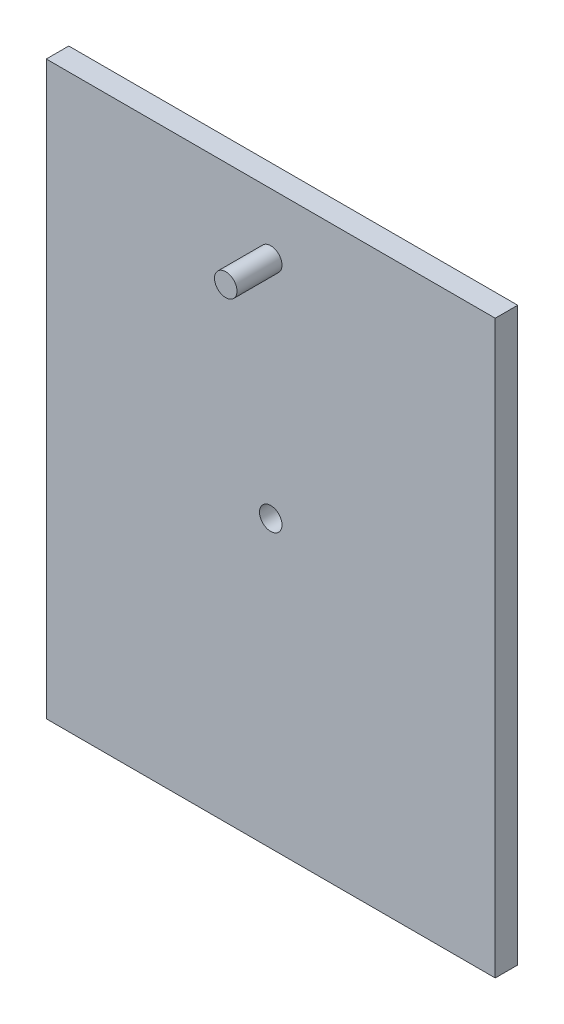
ISO-10303-21;
HEADER;
FILE_DESCRIPTION(('STEP AP214'),'2;1');
FILE_NAME('part.step','',(''),(''),'','','');
FILE_SCHEMA(('AUTOMOTIVE_DESIGN { 1 0 10303 214 1 1 1 1 }'));
ENDSEC;
DATA;
#1=APPLICATION_CONTEXT('core data for automotive mechanical design processes');
#2=APPLICATION_PROTOCOL_DEFINITION('international standard','automotive_design',2000,#1);
#3=PRODUCT_CONTEXT('',#1,'mechanical');
#4=PRODUCT('Part','Part','',(#3));
#5=PRODUCT_RELATED_PRODUCT_CATEGORY('part','',(#4));
#6=PRODUCT_DEFINITION_FORMATION('','',#4);
#7=PRODUCT_DEFINITION_CONTEXT('part definition',#1,'design');
#8=PRODUCT_DEFINITION('design','',#6,#7);
#9=PRODUCT_DEFINITION_SHAPE('','',#8);
#10=(LENGTH_UNIT() NAMED_UNIT(*) SI_UNIT(.MILLI.,.METRE.));
#11=(NAMED_UNIT(*) PLANE_ANGLE_UNIT() SI_UNIT($,.RADIAN.));
#12=(NAMED_UNIT(*) SI_UNIT($,.STERADIAN.) SOLID_ANGLE_UNIT());
#13=UNCERTAINTY_MEASURE_WITH_UNIT(LENGTH_MEASURE(1.E-05),#10,'distance_accuracy_value','');
#14=(GEOMETRIC_REPRESENTATION_CONTEXT(3) GLOBAL_UNCERTAINTY_ASSIGNED_CONTEXT((#13)) GLOBAL_UNIT_ASSIGNED_CONTEXT((#10,
#11,#12)) REPRESENTATION_CONTEXT('',''));
#15=CARTESIAN_POINT('',(0.,0.,0.));
#16=DIRECTION('',(0.,0.,1.));
#17=DIRECTION('',(1.,0.,0.));
#18=AXIS2_PLACEMENT_3D('',#15,#16,#17);
#19=CARTESIAN_POINT('',(0.,0.,20.));
#20=DIRECTION('',(0.,0.,1.));
#21=DIRECTION('',(1.,0.,0.));
#22=AXIS2_PLACEMENT_3D('',#19,#20,#21);
#23=PLANE('',#22);
#24=CARTESIAN_POINT('',(0.,0.,20.));
#25=DIRECTION('',(0.,0.,1.));
#26=DIRECTION('',(1.,0.,0.));
#27=AXIS2_PLACEMENT_3D('',#24,#25,#26);
#28=CIRCLE('',#27,10.);
#29=CARTESIAN_POINT('',(10.,0.,20.));
#30=VERTEX_POINT('',#29);
#31=EDGE_CURVE('E104',#30,#30,#28,.T.);
#32=ORIENTED_EDGE('',*,*,#31,.F.);
#33=EDGE_LOOP('',(#32));
#34=FACE_BOUND('',#33,.T.);
#35=DIRECTION('',(0.,1.,0.));
#36=VECTOR('',#35,1.);
#37=CARTESIAN_POINT('',(199.571858092099,254.,20.));
#38=LINE('',#37,#36);
#39=CARTESIAN_POINT('',(199.571858092099,-254.,20.));
#40=VERTEX_POINT('',#39);
#41=CARTESIAN_POINT('',(199.571858092099,254.,20.));
#42=VERTEX_POINT('',#41);
#43=EDGE_CURVE('E89',#40,#42,#38,.T.);
#44=ORIENTED_EDGE('',*,*,#43,.T.);
#45=DIRECTION('',(-1.,0.,0.));
#46=VECTOR('',#45,1.);
#47=CARTESIAN_POINT('',(-199.571858092099,254.,20.));
#48=LINE('',#47,#46);
#49=CARTESIAN_POINT('',(-199.571858092099,254.,20.));
#50=VERTEX_POINT('',#49);
#51=EDGE_CURVE('E84',#42,#50,#48,.T.);
#52=ORIENTED_EDGE('',*,*,#51,.T.);
#53=DIRECTION('',(0.,-1.,0.));
#54=VECTOR('',#53,1.);
#55=CARTESIAN_POINT('',(-199.571858092099,254.,20.));
#56=LINE('',#55,#54);
#57=CARTESIAN_POINT('',(-199.571858092099,-254.,20.));
#58=VERTEX_POINT('',#57);
#59=EDGE_CURVE('E87',#50,#58,#56,.T.);
#60=ORIENTED_EDGE('',*,*,#59,.T.);
#61=DIRECTION('',(1.,0.,0.));
#62=VECTOR('',#61,1.);
#63=CARTESIAN_POINT('',(-199.571858092099,-254.,20.));
#64=LINE('',#63,#62);
#65=EDGE_CURVE('E54',#58,#40,#64,.T.);
#66=ORIENTED_EDGE('',*,*,#65,.T.);
#67=EDGE_LOOP('',(#44,#52,#60,#66));
#68=FACE_BOUND('',#67,.T.);
#69=CARTESIAN_POINT('',(0.,200.,20.));
#70=DIRECTION('',(0.,0.,1.));
#71=DIRECTION('',(1.,0.,0.));
#72=AXIS2_PLACEMENT_3D('',#69,#70,#71);
#73=CIRCLE('',#72,10.);
#74=CARTESIAN_POINT('',(9.99999999999995,200.,20.));
#75=VERTEX_POINT('',#74);
#76=EDGE_CURVE('E119',#75,#75,#73,.T.);
#77=ORIENTED_EDGE('',*,*,#76,.F.);
#78=EDGE_LOOP('',(#77));
#79=FACE_BOUND('',#78,.T.);
#80=ADVANCED_FACE('F37',(#34,#68,#79),#23,.T.);
#81=CARTESIAN_POINT('',(0.,0.,0.));
#82=DIRECTION('',(0.,0.,1.));
#83=DIRECTION('',(1.,0.,0.));
#84=AXIS2_PLACEMENT_3D('',#81,#82,#83);
#85=PLANE('',#84);
#86=DIRECTION('',(0.,1.,0.));
#87=VECTOR('',#86,1.);
#88=CARTESIAN_POINT('',(199.571858092099,254.,0.));
#89=LINE('',#88,#87);
#90=CARTESIAN_POINT('',(199.571858092099,-254.,0.));
#91=VERTEX_POINT('',#90);
#92=CARTESIAN_POINT('',(199.571858092099,254.,0.));
#93=VERTEX_POINT('',#92);
#94=EDGE_CURVE('E101',#91,#93,#89,.T.);
#95=ORIENTED_EDGE('',*,*,#94,.F.);
#96=DIRECTION('',(1.,0.,0.));
#97=VECTOR('',#96,1.);
#98=CARTESIAN_POINT('',(-199.571858092099,-254.,0.));
#99=LINE('',#98,#97);
#100=CARTESIAN_POINT('',(-199.571858092099,-254.,0.));
#101=VERTEX_POINT('',#100);
#102=EDGE_CURVE('E77',#101,#91,#99,.T.);
#103=ORIENTED_EDGE('',*,*,#102,.F.);
#104=DIRECTION('',(0.,-1.,0.));
#105=VECTOR('',#104,1.);
#106=CARTESIAN_POINT('',(-199.571858092099,254.,0.));
#107=LINE('',#106,#105);
#108=CARTESIAN_POINT('',(-199.571858092099,254.,0.));
#109=VERTEX_POINT('',#108);
#110=EDGE_CURVE('E71',#109,#101,#107,.T.);
#111=ORIENTED_EDGE('',*,*,#110,.F.);
#112=DIRECTION('',(-1.,0.,0.));
#113=VECTOR('',#112,1.);
#114=CARTESIAN_POINT('',(-199.571858092099,254.,0.));
#115=LINE('',#114,#113);
#116=EDGE_CURVE('E93',#93,#109,#115,.T.);
#117=ORIENTED_EDGE('',*,*,#116,.F.);
#118=EDGE_LOOP('',(#95,#103,#111,#117));
#119=FACE_BOUND('',#118,.T.);
#120=CARTESIAN_POINT('',(0.,0.,0.));
#121=DIRECTION('',(0.,0.,1.));
#122=DIRECTION('',(1.,0.,0.));
#123=AXIS2_PLACEMENT_3D('',#120,#121,#122);
#124=CIRCLE('',#123,10.);
#125=CARTESIAN_POINT('',(10.,0.,0.));
#126=VERTEX_POINT('',#125);
#127=EDGE_CURVE('E116',#126,#126,#124,.T.);
#128=ORIENTED_EDGE('',*,*,#127,.T.);
#129=EDGE_LOOP('',(#128));
#130=FACE_BOUND('',#129,.T.);
#131=ADVANCED_FACE('F112',(#119,#130),#85,.F.);
#132=CARTESIAN_POINT('',(199.571858092099,254.,20.));
#133=DIRECTION('',(-1.,0.,0.));
#134=DIRECTION('',(0.,0.,1.));
#135=AXIS2_PLACEMENT_3D('',#132,#133,#134);
#136=PLANE('',#135);
#137=ORIENTED_EDGE('',*,*,#94,.T.);
#138=DIRECTION('',(0.,0.,-1.));
#139=VECTOR('',#138,1.);
#140=CARTESIAN_POINT('',(199.571858092099,254.,20.));
#141=LINE('',#140,#139);
#142=EDGE_CURVE('E11',#42,#93,#141,.T.);
#143=ORIENTED_EDGE('',*,*,#142,.F.);
#144=ORIENTED_EDGE('',*,*,#43,.F.);
#145=DIRECTION('',(0.,0.,-1.));
#146=VECTOR('',#145,1.);
#147=CARTESIAN_POINT('',(199.571858092099,-254.,20.));
#148=LINE('',#147,#146);
#149=EDGE_CURVE('E97',#40,#91,#148,.T.);
#150=ORIENTED_EDGE('',*,*,#149,.T.);
#151=EDGE_LOOP('',(#137,#143,#144,#150));
#152=FACE_BOUND('',#151,.T.);
#153=ADVANCED_FACE('F39',(#152),#136,.F.);
#154=CARTESIAN_POINT('',(-199.571858092099,254.,20.));
#155=DIRECTION('',(0.,-1.,0.));
#156=DIRECTION('',(0.,0.,-1.));
#157=AXIS2_PLACEMENT_3D('',#154,#155,#156);
#158=PLANE('',#157);
#159=ORIENTED_EDGE('',*,*,#116,.T.);
#160=DIRECTION('',(0.,0.,-1.));
#161=VECTOR('',#160,1.);
#162=CARTESIAN_POINT('',(-199.571858092099,254.,20.));
#163=LINE('',#162,#161);
#164=EDGE_CURVE('E46',#50,#109,#163,.T.);
#165=ORIENTED_EDGE('',*,*,#164,.F.);
#166=ORIENTED_EDGE('',*,*,#51,.F.);
#167=ORIENTED_EDGE('',*,*,#142,.T.);
#168=EDGE_LOOP('',(#159,#165,#166,#167));
#169=FACE_BOUND('',#168,.T.);
#170=ADVANCED_FACE('F92',(#169),#158,.F.);
#171=CARTESIAN_POINT('',(-199.571858092099,254.,20.));
#172=DIRECTION('',(1.,0.,0.));
#173=DIRECTION('',(0.,0.,-1.));
#174=AXIS2_PLACEMENT_3D('',#171,#172,#173);
#175=PLANE('',#174);
#176=ORIENTED_EDGE('',*,*,#110,.T.);
#177=DIRECTION('',(0.,0.,-1.));
#178=VECTOR('',#177,1.);
#179=CARTESIAN_POINT('',(-199.571858092099,-254.,20.));
#180=LINE('',#179,#178);
#181=EDGE_CURVE('E94',#58,#101,#180,.T.);
#182=ORIENTED_EDGE('',*,*,#181,.F.);
#183=ORIENTED_EDGE('',*,*,#59,.F.);
#184=ORIENTED_EDGE('',*,*,#164,.T.);
#185=EDGE_LOOP('',(#176,#182,#183,#184));
#186=FACE_BOUND('',#185,.T.);
#187=ADVANCED_FACE('F95',(#186),#175,.F.);
#188=CARTESIAN_POINT('',(-199.571858092099,-254.,20.));
#189=DIRECTION('',(0.,1.,0.));
#190=DIRECTION('',(0.,0.,1.));
#191=AXIS2_PLACEMENT_3D('',#188,#189,#190);
#192=PLANE('',#191);
#193=ORIENTED_EDGE('',*,*,#102,.T.);
#194=ORIENTED_EDGE('',*,*,#149,.F.);
#195=ORIENTED_EDGE('',*,*,#65,.F.);
#196=ORIENTED_EDGE('',*,*,#181,.T.);
#197=EDGE_LOOP('',(#193,#194,#195,#196));
#198=FACE_BOUND('',#197,.T.);
#199=ADVANCED_FACE('F109',(#198),#192,.F.);
#200=CARTESIAN_POINT('',(0.,0.,20.));
#201=DIRECTION('',(0.,0.,-1.));
#202=DIRECTION('',(-1.,0.,0.));
#203=AXIS2_PLACEMENT_3D('',#200,#201,#202);
#204=CYLINDRICAL_SURFACE('',#203,10.);
#205=ORIENTED_EDGE('',*,*,#31,.T.);
#206=EDGE_LOOP('',(#205));
#207=FACE_BOUND('',#206,.T.);
#208=ORIENTED_EDGE('',*,*,#127,.F.);
#209=EDGE_LOOP('',(#208));
#210=FACE_BOUND('',#209,.T.);
#211=ADVANCED_FACE('F132',(#207,#210),#204,.F.);
#212=CARTESIAN_POINT('',(0.,200.,60.));
#213=DIRECTION('',(0.,0.,-1.));
#214=DIRECTION('',(-1.,0.,0.));
#215=AXIS2_PLACEMENT_3D('',#212,#213,#214);
#216=CYLINDRICAL_SURFACE('',#215,10.);
#217=ORIENTED_EDGE('',*,*,#76,.T.);
#218=EDGE_LOOP('',(#217));
#219=FACE_BOUND('',#218,.T.);
#220=CARTESIAN_POINT('',(0.,200.,60.));
#221=DIRECTION('',(0.,0.,1.));
#222=DIRECTION('',(1.,0.,0.));
#223=AXIS2_PLACEMENT_3D('',#220,#221,#222);
#224=CIRCLE('',#223,10.);
#225=CARTESIAN_POINT('',(9.99999999999995,200.,60.));
#226=VERTEX_POINT('',#225);
#227=EDGE_CURVE('E124',#226,#226,#224,.T.);
#228=ORIENTED_EDGE('',*,*,#227,.F.);
#229=EDGE_LOOP('',(#228));
#230=FACE_BOUND('',#229,.T.);
#231=ADVANCED_FACE('F130',(#219,#230),#216,.T.);
#232=CARTESIAN_POINT('',(0.,200.,60.));
#233=DIRECTION('',(0.,0.,1.));
#234=DIRECTION('',(1.,0.,0.));
#235=AXIS2_PLACEMENT_3D('',#232,#233,#234);
#236=PLANE('',#235);
#237=ORIENTED_EDGE('',*,*,#227,.T.);
#238=EDGE_LOOP('',(#237));
#239=FACE_BOUND('',#238,.T.);
#240=ADVANCED_FACE('F128',(#239),#236,.T.);
#241=CLOSED_SHELL('',(#80,#131,#153,#170,#187,#199,#211,#231,#240));
#242=MANIFOLD_SOLID_BREP('B2',#241);
#243=ADVANCED_BREP_SHAPE_REPRESENTATION('',(#18,#242),#14);
#244=SHAPE_DEFINITION_REPRESENTATION(#9,#243);
ENDSEC;
END-ISO-10303-21;
